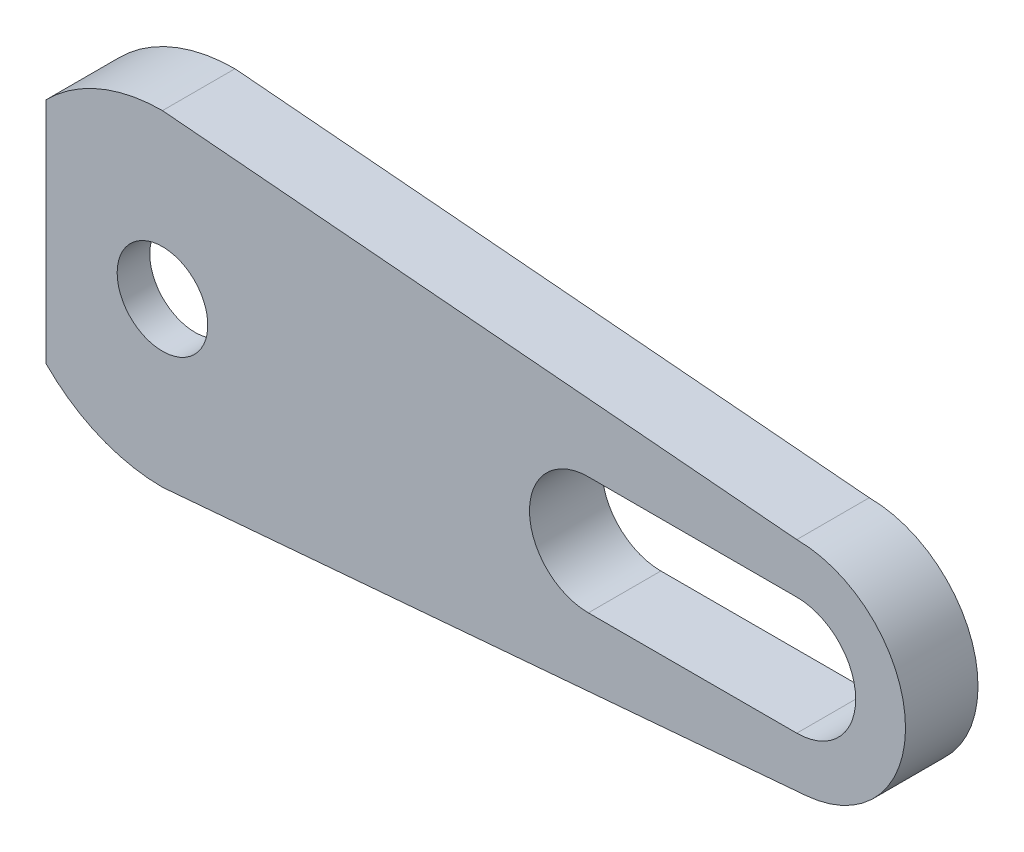
ISO-10303-21;
HEADER;
FILE_DESCRIPTION(('STEP AP214'),'2;1');
FILE_NAME('part.step','',(''),(''),'','','');
FILE_SCHEMA(('AUTOMOTIVE_DESIGN { 1 0 10303 214 1 1 1 1 }'));
ENDSEC;
DATA;
#1=APPLICATION_CONTEXT('core data for automotive mechanical design processes');
#2=APPLICATION_PROTOCOL_DEFINITION('international standard','automotive_design',2000,#1);
#3=PRODUCT_CONTEXT('',#1,'mechanical');
#4=PRODUCT('Part','Part','',(#3));
#5=PRODUCT_RELATED_PRODUCT_CATEGORY('part','',(#4));
#6=PRODUCT_DEFINITION_FORMATION('','',#4);
#7=PRODUCT_DEFINITION_CONTEXT('part definition',#1,'design');
#8=PRODUCT_DEFINITION('design','',#6,#7);
#9=PRODUCT_DEFINITION_SHAPE('','',#8);
#10=(LENGTH_UNIT() NAMED_UNIT(*) SI_UNIT(.MILLI.,.METRE.));
#11=(NAMED_UNIT(*) PLANE_ANGLE_UNIT() SI_UNIT($,.RADIAN.));
#12=(NAMED_UNIT(*) SI_UNIT($,.STERADIAN.) SOLID_ANGLE_UNIT());
#13=UNCERTAINTY_MEASURE_WITH_UNIT(LENGTH_MEASURE(1.E-05),#10,'distance_accuracy_value','');
#14=(GEOMETRIC_REPRESENTATION_CONTEXT(3) GLOBAL_UNCERTAINTY_ASSIGNED_CONTEXT((#13)) GLOBAL_UNIT_ASSIGNED_CONTEXT((#10,
#11,#12)) REPRESENTATION_CONTEXT('',''));
#15=CARTESIAN_POINT('',(0.,0.,0.));
#16=DIRECTION('',(0.,0.,1.));
#17=DIRECTION('',(1.,0.,0.));
#18=AXIS2_PLACEMENT_3D('',#15,#16,#17);
#19=CARTESIAN_POINT('',(0.,0.,4.));
#20=DIRECTION('',(0.,0.,-1.));
#21=DIRECTION('',(-1.,0.,0.));
#22=AXIS2_PLACEMENT_3D('',#19,#20,#21);
#23=PLANE('',#22);
#24=DIRECTION('',(1.,0.,0.));
#25=VECTOR('',#24,1.);
#26=CARTESIAN_POINT('',(23.5,-3.25,4.));
#27=LINE('',#26,#25);
#28=CARTESIAN_POINT('',(23.5,-3.25,4.));
#29=VERTEX_POINT('',#28);
#30=CARTESIAN_POINT('',(35.,-3.25,4.));
#31=VERTEX_POINT('',#30);
#32=EDGE_CURVE('E272',#29,#31,#27,.T.);
#33=ORIENTED_EDGE('',*,*,#32,.F.);
#34=CARTESIAN_POINT('',(23.5,0.,4.));
#35=DIRECTION('',(0.,0.,1.));
#36=DIRECTION('',(1.,0.,0.));
#37=AXIS2_PLACEMENT_3D('',#34,#35,#36);
#38=CIRCLE('',#37,3.25);
#39=CARTESIAN_POINT('',(23.5,3.25,4.));
#40=VERTEX_POINT('',#39);
#41=EDGE_CURVE('E260',#40,#29,#38,.T.);
#42=ORIENTED_EDGE('',*,*,#41,.F.);
#43=DIRECTION('',(-1.,0.,0.));
#44=VECTOR('',#43,1.);
#45=CARTESIAN_POINT('',(23.5,3.25,4.));
#46=LINE('',#45,#44);
#47=CARTESIAN_POINT('',(35.,3.25,4.));
#48=VERTEX_POINT('',#47);
#49=EDGE_CURVE('E256',#48,#40,#46,.T.);
#50=ORIENTED_EDGE('',*,*,#49,.F.);
#51=CARTESIAN_POINT('',(35.,0.,4.));
#52=DIRECTION('',(0.,0.,1.));
#53=DIRECTION('',(-1.,0.,0.));
#54=AXIS2_PLACEMENT_3D('',#51,#52,#53);
#55=CIRCLE('',#54,3.25);
#56=EDGE_CURVE('E270',#31,#48,#55,.T.);
#57=ORIENTED_EDGE('',*,*,#56,.F.);
#58=EDGE_LOOP('',(#33,#42,#50,#57));
#59=FACE_BOUND('',#58,.T.);
#60=DIRECTION('',(0.996398987507184,0.0847883110732758,0.));
#61=VECTOR('',#60,1.);
#62=CARTESIAN_POINT('',(0.,-9.,4.));
#63=LINE('',#62,#61);
#64=CARTESIAN_POINT('',(0.,-9.,4.));
#65=VERTEX_POINT('',#64);
#66=CARTESIAN_POINT('',(35.5087298664397,-5.97839392504311,4.));
#67=VERTEX_POINT('',#66);
#68=EDGE_CURVE('E243',#65,#67,#63,.T.);
#69=ORIENTED_EDGE('',*,*,#68,.T.);
#70=CARTESIAN_POINT('',(35.,0.,4.));
#71=DIRECTION('',(0.,0.,1.));
#72=DIRECTION('',(-1.,0.,0.));
#73=AXIS2_PLACEMENT_3D('',#70,#71,#72);
#74=CIRCLE('',#73,6.);
#75=CARTESIAN_POINT('',(35.,6.,4.));
#76=VERTEX_POINT('',#75);
#77=EDGE_CURVE('E241',#67,#76,#74,.T.);
#78=ORIENTED_EDGE('',*,*,#77,.T.);
#79=DIRECTION('',(-0.996346649041751,0.0854011413464358,0.));
#80=VECTOR('',#79,1.);
#81=CARTESIAN_POINT('',(0.,9.,4.));
#82=LINE('',#81,#80);
#83=CARTESIAN_POINT('',(0.,9.,4.));
#84=VERTEX_POINT('',#83);
#85=EDGE_CURVE('E207',#76,#84,#82,.T.);
#86=ORIENTED_EDGE('',*,*,#85,.T.);
#87=CARTESIAN_POINT('',(0.,0.,4.));
#88=DIRECTION('',(0.,0.,1.));
#89=DIRECTION('',(-1.,0.,0.));
#90=AXIS2_PLACEMENT_3D('',#87,#88,#89);
#91=CIRCLE('',#90,9.);
#92=CARTESIAN_POINT('',(-6.42654307097902,6.30075742723457,4.));
#93=VERTEX_POINT('',#92);
#94=EDGE_CURVE('E211',#84,#93,#91,.T.);
#95=ORIENTED_EDGE('',*,*,#94,.T.);
#96=DIRECTION('',(0.,1.,0.));
#97=VECTOR('',#96,1.);
#98=CARTESIAN_POINT('',(-6.42654307097901,-6.30075742723457,4.));
#99=LINE('',#98,#97);
#100=CARTESIAN_POINT('',(-6.42654307097901,-6.30075742723457,4.));
#101=VERTEX_POINT('',#100);
#102=EDGE_CURVE('E160',#101,#93,#99,.T.);
#103=ORIENTED_EDGE('',*,*,#102,.F.);
#104=CARTESIAN_POINT('',(0.,0.,4.));
#105=DIRECTION('',(0.,0.,1.));
#106=DIRECTION('',(1.,0.,0.));
#107=AXIS2_PLACEMENT_3D('',#104,#105,#106);
#108=CIRCLE('',#107,9.);
#109=EDGE_CURVE('E245',#101,#65,#108,.T.);
#110=ORIENTED_EDGE('',*,*,#109,.T.);
#111=EDGE_LOOP('',(#69,#78,#86,#95,#103,#110));
#112=FACE_BOUND('',#111,.T.);
#113=CARTESIAN_POINT('',(0.,0.,4.));
#114=DIRECTION('',(0.,0.,-1.));
#115=DIRECTION('',(-1.,0.,0.));
#116=AXIS2_PLACEMENT_3D('',#113,#114,#115);
#117=CIRCLE('',#116,2.5);
#118=CARTESIAN_POINT('',(-2.5,0.,4.));
#119=VERTEX_POINT('',#118);
#120=EDGE_CURVE('E291',#119,#119,#117,.T.);
#121=ORIENTED_EDGE('',*,*,#120,.T.);
#122=EDGE_LOOP('',(#121));
#123=FACE_BOUND('',#122,.T.);
#124=ADVANCED_FACE('F35',(#59,#112,#123),#23,.F.);
#125=CARTESIAN_POINT('',(0.,0.,0.));
#126=DIRECTION('',(0.,0.,-1.));
#127=DIRECTION('',(-1.,0.,0.));
#128=AXIS2_PLACEMENT_3D('',#125,#126,#127);
#129=PLANE('',#128);
#130=CARTESIAN_POINT('',(0.,0.,0.));
#131=DIRECTION('',(0.,0.,1.));
#132=DIRECTION('',(-1.,0.,0.));
#133=AXIS2_PLACEMENT_3D('',#130,#131,#132);
#134=CIRCLE('',#133,9.);
#135=CARTESIAN_POINT('',(0.,9.,0.));
#136=VERTEX_POINT('',#135);
#137=CARTESIAN_POINT('',(-6.42654307097901,6.30075742723457,0.));
#138=VERTEX_POINT('',#137);
#139=EDGE_CURVE('E179',#136,#138,#134,.T.);
#140=ORIENTED_EDGE('',*,*,#139,.F.);
#141=DIRECTION('',(-0.996346649041751,0.0854011413464358,0.));
#142=VECTOR('',#141,1.);
#143=CARTESIAN_POINT('',(0.,9.,0.));
#144=LINE('',#143,#142);
#145=CARTESIAN_POINT('',(35.,6.,0.));
#146=VERTEX_POINT('',#145);
#147=EDGE_CURVE('E208',#146,#136,#144,.T.);
#148=ORIENTED_EDGE('',*,*,#147,.F.);
#149=CARTESIAN_POINT('',(35.,0.,0.));
#150=DIRECTION('',(0.,0.,1.));
#151=DIRECTION('',(-1.,0.,0.));
#152=AXIS2_PLACEMENT_3D('',#149,#150,#151);
#153=CIRCLE('',#152,6.);
#154=CARTESIAN_POINT('',(35.5087298664397,-5.97839392504311,0.));
#155=VERTEX_POINT('',#154);
#156=EDGE_CURVE('E212',#155,#146,#153,.T.);
#157=ORIENTED_EDGE('',*,*,#156,.F.);
#158=DIRECTION('',(0.996398987507184,0.0847883110732758,0.));
#159=VECTOR('',#158,1.);
#160=CARTESIAN_POINT('',(0.,-9.,0.));
#161=LINE('',#160,#159);
#162=CARTESIAN_POINT('',(0.,-9.,0.));
#163=VERTEX_POINT('',#162);
#164=EDGE_CURVE('E214',#163,#155,#161,.T.);
#165=ORIENTED_EDGE('',*,*,#164,.F.);
#166=CARTESIAN_POINT('',(0.,0.,0.));
#167=DIRECTION('',(0.,0.,1.));
#168=DIRECTION('',(1.,0.,0.));
#169=AXIS2_PLACEMENT_3D('',#166,#167,#168);
#170=CIRCLE('',#169,9.);
#171=CARTESIAN_POINT('',(-6.42654307097901,-6.30075742723457,0.));
#172=VERTEX_POINT('',#171);
#173=EDGE_CURVE('E216',#172,#163,#170,.T.);
#174=ORIENTED_EDGE('',*,*,#173,.F.);
#175=DIRECTION('',(-0.707106781186548,-0.707106781186548,0.));
#176=VECTOR('',#175,1.);
#177=CARTESIAN_POINT('',(-4.37578564374445,-4.25,0.));
#178=LINE('',#177,#176);
#179=CARTESIAN_POINT('',(-4.37578564374444,-4.25,0.));
#180=VERTEX_POINT('',#179);
#181=EDGE_CURVE('E219',#180,#172,#178,.T.);
#182=ORIENTED_EDGE('',*,*,#181,.F.);
#183=CARTESIAN_POINT('',(0.,0.,0.));
#184=DIRECTION('',(0.,0.,-1.));
#185=DIRECTION('',(-1.,0.,0.));
#186=AXIS2_PLACEMENT_3D('',#183,#184,#185);
#187=CIRCLE('',#186,6.1);
#188=CARTESIAN_POINT('',(4.37578564374445,-4.25,0.));
#189=VERTEX_POINT('',#188);
#190=EDGE_CURVE('E222',#189,#180,#187,.T.);
#191=ORIENTED_EDGE('',*,*,#190,.F.);
#192=DIRECTION('',(-0.993627549913592,-0.112713317991759,0.));
#193=VECTOR('',#192,1.);
#194=CARTESIAN_POINT('',(17.3155972903769,-2.78215713975806,0.));
#195=LINE('',#194,#193);
#196=CARTESIAN_POINT('',(17.3155972903769,-2.78215713975806,0.));
#197=VERTEX_POINT('',#196);
#198=EDGE_CURVE('E225',#197,#189,#195,.T.);
#199=ORIENTED_EDGE('',*,*,#198,.F.);
#200=CARTESIAN_POINT('',(17.,0.,0.));
#201=DIRECTION('',(0.,0.,-1.));
#202=DIRECTION('',(1.,0.,0.));
#203=AXIS2_PLACEMENT_3D('',#200,#201,#202);
#204=CIRCLE('',#203,2.8);
#205=CARTESIAN_POINT('',(17.3155972903769,2.78215713975806,0.));
#206=VERTEX_POINT('',#205);
#207=EDGE_CURVE('E228',#206,#197,#204,.T.);
#208=ORIENTED_EDGE('',*,*,#207,.F.);
#209=DIRECTION('',(0.993627549913592,-0.112713317991759,0.));
#210=VECTOR('',#209,1.);
#211=CARTESIAN_POINT('',(4.37578564374445,4.25,0.));
#212=LINE('',#211,#210);
#213=CARTESIAN_POINT('',(4.37578564374445,4.25,0.));
#214=VERTEX_POINT('',#213);
#215=EDGE_CURVE('E231',#214,#206,#212,.T.);
#216=ORIENTED_EDGE('',*,*,#215,.F.);
#217=CARTESIAN_POINT('',(0.,0.,0.));
#218=DIRECTION('',(0.,0.,-1.));
#219=DIRECTION('',(1.,0.,0.));
#220=AXIS2_PLACEMENT_3D('',#217,#218,#219);
#221=CIRCLE('',#220,6.1);
#222=CARTESIAN_POINT('',(-4.37578564374445,4.25,0.));
#223=VERTEX_POINT('',#222);
#224=EDGE_CURVE('E234',#223,#214,#221,.T.);
#225=ORIENTED_EDGE('',*,*,#224,.F.);
#226=DIRECTION('',(0.707106781186548,-0.707106781186548,0.));
#227=VECTOR('',#226,1.);
#228=CARTESIAN_POINT('',(-4.37578564374445,4.25,0.));
#229=LINE('',#228,#227);
#230=EDGE_CURVE('E236',#138,#223,#229,.T.);
#231=ORIENTED_EDGE('',*,*,#230,.F.);
#232=EDGE_LOOP('',(#140,#148,#157,#165,#174,#182,#191,#199,#208,#216,#225,#231));
#233=FACE_BOUND('',#232,.T.);
#234=DIRECTION('',(-1.,0.,0.));
#235=VECTOR('',#234,1.);
#236=CARTESIAN_POINT('',(23.5,3.25,0.));
#237=LINE('',#236,#235);
#238=CARTESIAN_POINT('',(35.,3.25,0.));
#239=VERTEX_POINT('',#238);
#240=CARTESIAN_POINT('',(23.5,3.25,0.));
#241=VERTEX_POINT('',#240);
#242=EDGE_CURVE('E257',#239,#241,#237,.T.);
#243=ORIENTED_EDGE('',*,*,#242,.T.);
#244=CARTESIAN_POINT('',(23.5,0.,0.));
#245=DIRECTION('',(0.,0.,1.));
#246=DIRECTION('',(1.,0.,0.));
#247=AXIS2_PLACEMENT_3D('',#244,#245,#246);
#248=CIRCLE('',#247,3.25);
#249=CARTESIAN_POINT('',(23.5,-3.25,0.));
#250=VERTEX_POINT('',#249);
#251=EDGE_CURVE('E174',#241,#250,#248,.T.);
#252=ORIENTED_EDGE('',*,*,#251,.T.);
#253=DIRECTION('',(1.,0.,0.));
#254=VECTOR('',#253,1.);
#255=CARTESIAN_POINT('',(23.5,-3.25,0.));
#256=LINE('',#255,#254);
#257=CARTESIAN_POINT('',(35.,-3.25,0.));
#258=VERTEX_POINT('',#257);
#259=EDGE_CURVE('E264',#250,#258,#256,.T.);
#260=ORIENTED_EDGE('',*,*,#259,.T.);
#261=CARTESIAN_POINT('',(35.,0.,0.));
#262=DIRECTION('',(0.,0.,1.));
#263=DIRECTION('',(-1.,0.,0.));
#264=AXIS2_PLACEMENT_3D('',#261,#262,#263);
#265=CIRCLE('',#264,3.25);
#266=EDGE_CURVE('E261',#258,#239,#265,.T.);
#267=ORIENTED_EDGE('',*,*,#266,.T.);
#268=EDGE_LOOP('',(#243,#252,#260,#267));
#269=FACE_BOUND('',#268,.T.);
#270=ADVANCED_FACE('F311',(#233,#269),#129,.T.);
#271=CARTESIAN_POINT('',(0.,0.,4.));
#272=DIRECTION('',(0.,0.,-1.));
#273=DIRECTION('',(-1.,0.,0.));
#274=AXIS2_PLACEMENT_3D('',#271,#272,#273);
#275=CYLINDRICAL_SURFACE('',#274,9.);
#276=DIRECTION('',(0.,0.,-1.));
#277=VECTOR('',#276,1.);
#278=CARTESIAN_POINT('',(-6.42654307097901,6.30075742723457,4.));
#279=LINE('',#278,#277);
#280=CARTESIAN_POINT('',(-6.42654307097902,6.30075742723457,2.2));
#281=VERTEX_POINT('',#280);
#282=EDGE_CURVE('E43',#281,#138,#279,.T.);
#283=ORIENTED_EDGE('',*,*,#282,.F.);
#284=EDGE_CURVE('E11',#93,#281,#279,.T.);
#285=ORIENTED_EDGE('',*,*,#284,.F.);
#286=ORIENTED_EDGE('',*,*,#94,.F.);
#287=DIRECTION('',(0.,0.,-1.));
#288=VECTOR('',#287,1.);
#289=CARTESIAN_POINT('',(0.,9.,4.));
#290=LINE('',#289,#288);
#291=EDGE_CURVE('E205',#84,#136,#290,.T.);
#292=ORIENTED_EDGE('',*,*,#291,.T.);
#293=ORIENTED_EDGE('',*,*,#139,.T.);
#294=EDGE_LOOP('',(#283,#285,#286,#292,#293));
#295=FACE_BOUND('',#294,.T.);
#296=ADVANCED_FACE('F37',(#295),#275,.T.);
#297=CARTESIAN_POINT('',(-4.37578564374445,4.25,4.));
#298=DIRECTION('',(0.707106781186547,0.707106781186547,0.));
#299=DIRECTION('',(-0.707106781186548,0.707106781186548,0.));
#300=AXIS2_PLACEMENT_3D('',#297,#298,#299);
#301=PLANE('',#300);
#302=DIRECTION('',(0.,0.,-1.));
#303=VECTOR('',#302,1.);
#304=CARTESIAN_POINT('',(-4.37578564374445,4.25,4.));
#305=LINE('',#304,#303);
#306=CARTESIAN_POINT('',(-4.37578564374445,4.25,2.2));
#307=VERTEX_POINT('',#306);
#308=EDGE_CURVE('E173',#307,#223,#305,.T.);
#309=ORIENTED_EDGE('',*,*,#308,.F.);
#310=DIRECTION('',(-0.707106781186548,0.707106781186548,0.));
#311=VECTOR('',#310,1.);
#312=CARTESIAN_POINT('',(-4.37578564374445,4.25,2.2));
#313=LINE('',#312,#311);
#314=EDGE_CURVE('E155',#307,#281,#313,.T.);
#315=ORIENTED_EDGE('',*,*,#314,.T.);
#316=ORIENTED_EDGE('',*,*,#282,.T.);
#317=ORIENTED_EDGE('',*,*,#230,.T.);
#318=EDGE_LOOP('',(#309,#315,#316,#317));
#319=FACE_BOUND('',#318,.T.);
#320=ADVANCED_FACE('F170',(#319),#301,.F.);
#321=CARTESIAN_POINT('',(0.,0.,4.));
#322=DIRECTION('',(0.,0.,-1.));
#323=DIRECTION('',(-1.,0.,0.));
#324=AXIS2_PLACEMENT_3D('',#321,#322,#323);
#325=CYLINDRICAL_SURFACE('',#324,6.1);
#326=DIRECTION('',(0.,0.,-1.));
#327=VECTOR('',#326,1.);
#328=CARTESIAN_POINT('',(4.37578564374445,4.25,4.));
#329=LINE('',#328,#327);
#330=CARTESIAN_POINT('',(4.37578564374445,4.25,2.2));
#331=VERTEX_POINT('',#330);
#332=EDGE_CURVE('E180',#331,#214,#329,.T.);
#333=ORIENTED_EDGE('',*,*,#332,.F.);
#334=CARTESIAN_POINT('',(0.,0.,2.2));
#335=DIRECTION('',(0.,0.,-1.));
#336=DIRECTION('',(-1.,0.,0.));
#337=AXIS2_PLACEMENT_3D('',#334,#335,#336);
#338=CIRCLE('',#337,6.1);
#339=EDGE_CURVE('E175',#331,#307,#338,.F.);
#340=ORIENTED_EDGE('',*,*,#339,.T.);
#341=ORIENTED_EDGE('',*,*,#308,.T.);
#342=ORIENTED_EDGE('',*,*,#224,.T.);
#343=EDGE_LOOP('',(#333,#340,#341,#342));
#344=FACE_BOUND('',#343,.T.);
#345=ADVANCED_FACE('F360',(#344),#325,.F.);
#346=CARTESIAN_POINT('',(4.37578564374445,4.25,4.));
#347=DIRECTION('',(0.112713317991759,0.993627549913592,0.));
#348=DIRECTION('',(-0.993627549913592,0.112713317991759,0.));
#349=AXIS2_PLACEMENT_3D('',#346,#347,#348);
#350=PLANE('',#349);
#351=DIRECTION('',(0.,0.,-1.));
#352=VECTOR('',#351,1.);
#353=CARTESIAN_POINT('',(17.3155972903769,2.78215713975806,4.));
#354=LINE('',#353,#352);
#355=CARTESIAN_POINT('',(17.3155972903769,2.78215713975806,2.2));
#356=VERTEX_POINT('',#355);
#357=EDGE_CURVE('E183',#356,#206,#354,.T.);
#358=ORIENTED_EDGE('',*,*,#357,.F.);
#359=DIRECTION('',(-0.993627549913592,0.112713317991759,0.));
#360=VECTOR('',#359,1.);
#361=CARTESIAN_POINT('',(4.37578564374445,4.25,2.2));
#362=LINE('',#361,#360);
#363=EDGE_CURVE('E276',#356,#331,#362,.T.);
#364=ORIENTED_EDGE('',*,*,#363,.T.);
#365=ORIENTED_EDGE('',*,*,#332,.T.);
#366=ORIENTED_EDGE('',*,*,#215,.T.);
#367=EDGE_LOOP('',(#358,#364,#365,#366));
#368=FACE_BOUND('',#367,.T.);
#369=ADVANCED_FACE('F356',(#368),#350,.F.);
#370=CARTESIAN_POINT('',(17.,0.,4.));
#371=DIRECTION('',(0.,0.,-1.));
#372=DIRECTION('',(-1.,0.,0.));
#373=AXIS2_PLACEMENT_3D('',#370,#371,#372);
#374=CYLINDRICAL_SURFACE('',#373,2.8);
#375=DIRECTION('',(0.,0.,-1.));
#376=VECTOR('',#375,1.);
#377=CARTESIAN_POINT('',(17.3155972903769,-2.78215713975806,4.));
#378=LINE('',#377,#376);
#379=CARTESIAN_POINT('',(17.3155972903769,-2.78215713975806,2.2));
#380=VERTEX_POINT('',#379);
#381=EDGE_CURVE('E187',#380,#197,#378,.T.);
#382=ORIENTED_EDGE('',*,*,#381,.F.);
#383=CARTESIAN_POINT('',(17.,0.,2.2));
#384=DIRECTION('',(0.,0.,-1.));
#385=DIRECTION('',(-1.,0.,0.));
#386=AXIS2_PLACEMENT_3D('',#383,#384,#385);
#387=CIRCLE('',#386,2.8);
#388=EDGE_CURVE('E279',#380,#356,#387,.F.);
#389=ORIENTED_EDGE('',*,*,#388,.T.);
#390=ORIENTED_EDGE('',*,*,#357,.T.);
#391=ORIENTED_EDGE('',*,*,#207,.T.);
#392=EDGE_LOOP('',(#382,#389,#390,#391));
#393=FACE_BOUND('',#392,.T.);
#394=ADVANCED_FACE('F352',(#393),#374,.F.);
#395=CARTESIAN_POINT('',(17.3155972903769,-2.78215713975806,4.));
#396=DIRECTION('',(0.112713317991759,-0.993627549913592,0.));
#397=DIRECTION('',(0.993627549913592,0.112713317991759,0.));
#398=AXIS2_PLACEMENT_3D('',#395,#396,#397);
#399=PLANE('',#398);
#400=DIRECTION('',(0.,0.,-1.));
#401=VECTOR('',#400,1.);
#402=CARTESIAN_POINT('',(4.37578564374445,-4.25,4.));
#403=LINE('',#402,#401);
#404=CARTESIAN_POINT('',(4.37578564374445,-4.25,2.2));
#405=VERTEX_POINT('',#404);
#406=EDGE_CURVE('E189',#405,#189,#403,.T.);
#407=ORIENTED_EDGE('',*,*,#406,.F.);
#408=DIRECTION('',(0.993627549913592,0.112713317991759,0.));
#409=VECTOR('',#408,1.);
#410=CARTESIAN_POINT('',(17.3155972903769,-2.78215713975806,2.2));
#411=LINE('',#410,#409);
#412=EDGE_CURVE('E282',#405,#380,#411,.T.);
#413=ORIENTED_EDGE('',*,*,#412,.T.);
#414=ORIENTED_EDGE('',*,*,#381,.T.);
#415=ORIENTED_EDGE('',*,*,#198,.T.);
#416=EDGE_LOOP('',(#407,#413,#414,#415));
#417=FACE_BOUND('',#416,.T.);
#418=ADVANCED_FACE('F348',(#417),#399,.F.);
#419=CARTESIAN_POINT('',(0.,0.,4.));
#420=DIRECTION('',(0.,0.,-1.));
#421=DIRECTION('',(-1.,0.,0.));
#422=AXIS2_PLACEMENT_3D('',#419,#420,#421);
#423=CYLINDRICAL_SURFACE('',#422,6.1);
#424=DIRECTION('',(0.,0.,-1.));
#425=VECTOR('',#424,1.);
#426=CARTESIAN_POINT('',(-4.37578564374444,-4.25,4.));
#427=LINE('',#426,#425);
#428=CARTESIAN_POINT('',(-4.37578564374445,-4.25,2.2));
#429=VERTEX_POINT('',#428);
#430=EDGE_CURVE('E191',#429,#180,#427,.T.);
#431=ORIENTED_EDGE('',*,*,#430,.F.);
#432=CARTESIAN_POINT('',(0.,0.,2.2));
#433=DIRECTION('',(0.,0.,-1.));
#434=DIRECTION('',(-1.,0.,0.));
#435=AXIS2_PLACEMENT_3D('',#432,#433,#434);
#436=CIRCLE('',#435,6.1);
#437=EDGE_CURVE('E285',#429,#405,#436,.F.);
#438=ORIENTED_EDGE('',*,*,#437,.T.);
#439=ORIENTED_EDGE('',*,*,#406,.T.);
#440=ORIENTED_EDGE('',*,*,#190,.T.);
#441=EDGE_LOOP('',(#431,#438,#439,#440));
#442=FACE_BOUND('',#441,.T.);
#443=ADVANCED_FACE('F344',(#442),#423,.F.);
#444=CARTESIAN_POINT('',(-4.37578564374445,-4.25,4.));
#445=DIRECTION('',(0.707106781186547,-0.707106781186547,0.));
#446=DIRECTION('',(0.707106781186548,0.707106781186548,0.));
#447=AXIS2_PLACEMENT_3D('',#444,#445,#446);
#448=PLANE('',#447);
#449=DIRECTION('',(0.,0.,-1.));
#450=VECTOR('',#449,1.);
#451=CARTESIAN_POINT('',(-6.42654307097901,-6.30075742723457,4.));
#452=LINE('',#451,#450);
#453=CARTESIAN_POINT('',(-6.42654307097901,-6.30075742723457,2.2));
#454=VERTEX_POINT('',#453);
#455=EDGE_CURVE('E196',#454,#172,#452,.T.);
#456=ORIENTED_EDGE('',*,*,#455,.F.);
#457=DIRECTION('',(0.707106781186548,0.707106781186548,0.));
#458=VECTOR('',#457,1.);
#459=CARTESIAN_POINT('',(-4.37578564374445,-4.25,2.2));
#460=LINE('',#459,#458);
#461=EDGE_CURVE('E158',#454,#429,#460,.T.);
#462=ORIENTED_EDGE('',*,*,#461,.T.);
#463=ORIENTED_EDGE('',*,*,#430,.T.);
#464=ORIENTED_EDGE('',*,*,#181,.T.);
#465=EDGE_LOOP('',(#456,#462,#463,#464));
#466=FACE_BOUND('',#465,.T.);
#467=ADVANCED_FACE('F340',(#466),#448,.F.);
#468=CARTESIAN_POINT('',(0.,0.,4.));
#469=DIRECTION('',(0.,0.,-1.));
#470=DIRECTION('',(-1.,0.,0.));
#471=AXIS2_PLACEMENT_3D('',#468,#469,#470);
#472=CYLINDRICAL_SURFACE('',#471,9.);
#473=ORIENTED_EDGE('',*,*,#173,.T.);
#474=DIRECTION('',(0.,0.,-1.));
#475=VECTOR('',#474,1.);
#476=CARTESIAN_POINT('',(0.,-9.,4.));
#477=LINE('',#476,#475);
#478=EDGE_CURVE('E197',#65,#163,#477,.T.);
#479=ORIENTED_EDGE('',*,*,#478,.F.);
#480=ORIENTED_EDGE('',*,*,#109,.F.);
#481=EDGE_CURVE('E193',#101,#454,#452,.T.);
#482=ORIENTED_EDGE('',*,*,#481,.T.);
#483=ORIENTED_EDGE('',*,*,#455,.T.);
#484=EDGE_LOOP('',(#473,#479,#480,#482,#483));
#485=FACE_BOUND('',#484,.T.);
#486=ADVANCED_FACE('F336',(#485),#472,.T.);
#487=CARTESIAN_POINT('',(0.,-9.,4.));
#488=DIRECTION('',(-0.0847883110732758,0.996398987507184,0.));
#489=DIRECTION('',(-0.996398987507184,-0.0847883110732758,0.));
#490=AXIS2_PLACEMENT_3D('',#487,#488,#489);
#491=PLANE('',#490);
#492=ORIENTED_EDGE('',*,*,#478,.T.);
#493=ORIENTED_EDGE('',*,*,#164,.T.);
#494=DIRECTION('',(0.,0.,-1.));
#495=VECTOR('',#494,1.);
#496=CARTESIAN_POINT('',(35.5087298664397,-5.97839392504311,4.));
#497=LINE('',#496,#495);
#498=EDGE_CURVE('E199',#67,#155,#497,.T.);
#499=ORIENTED_EDGE('',*,*,#498,.F.);
#500=ORIENTED_EDGE('',*,*,#68,.F.);
#501=EDGE_LOOP('',(#492,#493,#499,#500));
#502=FACE_BOUND('',#501,.T.);
#503=ADVANCED_FACE('F332',(#502),#491,.F.);
#504=CARTESIAN_POINT('',(35.,0.,4.));
#505=DIRECTION('',(0.,0.,-1.));
#506=DIRECTION('',(-1.,0.,0.));
#507=AXIS2_PLACEMENT_3D('',#504,#505,#506);
#508=CYLINDRICAL_SURFACE('',#507,6.);
#509=ORIENTED_EDGE('',*,*,#156,.T.);
#510=DIRECTION('',(0.,0.,-1.));
#511=VECTOR('',#510,1.);
#512=CARTESIAN_POINT('',(35.,6.,4.));
#513=LINE('',#512,#511);
#514=EDGE_CURVE('E202',#76,#146,#513,.T.);
#515=ORIENTED_EDGE('',*,*,#514,.F.);
#516=ORIENTED_EDGE('',*,*,#77,.F.);
#517=ORIENTED_EDGE('',*,*,#498,.T.);
#518=EDGE_LOOP('',(#509,#515,#516,#517));
#519=FACE_BOUND('',#518,.T.);
#520=ADVANCED_FACE('F328',(#519),#508,.T.);
#521=CARTESIAN_POINT('',(0.,9.,4.));
#522=DIRECTION('',(-0.0854011413464358,-0.996346649041751,0.));
#523=DIRECTION('',(0.996346649041751,-0.0854011413464358,0.));
#524=AXIS2_PLACEMENT_3D('',#521,#522,#523);
#525=PLANE('',#524);
#526=ORIENTED_EDGE('',*,*,#147,.T.);
#527=ORIENTED_EDGE('',*,*,#291,.F.);
#528=ORIENTED_EDGE('',*,*,#85,.F.);
#529=ORIENTED_EDGE('',*,*,#514,.T.);
#530=EDGE_LOOP('',(#526,#527,#528,#529));
#531=FACE_BOUND('',#530,.T.);
#532=ADVANCED_FACE('F325',(#531),#525,.F.);
#533=CARTESIAN_POINT('',(23.5,0.,4.));
#534=DIRECTION('',(0.,0.,-1.));
#535=DIRECTION('',(-1.,0.,0.));
#536=AXIS2_PLACEMENT_3D('',#533,#534,#535);
#537=CYLINDRICAL_SURFACE('',#536,3.25);
#538=ORIENTED_EDGE('',*,*,#41,.T.);
#539=DIRECTION('',(0.,0.,-1.));
#540=VECTOR('',#539,1.);
#541=CARTESIAN_POINT('',(23.5,-3.25,4.));
#542=LINE('',#541,#540);
#543=EDGE_CURVE('E239',#29,#250,#542,.T.);
#544=ORIENTED_EDGE('',*,*,#543,.T.);
#545=ORIENTED_EDGE('',*,*,#251,.F.);
#546=DIRECTION('',(0.,0.,-1.));
#547=VECTOR('',#546,1.);
#548=CARTESIAN_POINT('',(23.5,3.25,4.));
#549=LINE('',#548,#547);
#550=EDGE_CURVE('E253',#40,#241,#549,.T.);
#551=ORIENTED_EDGE('',*,*,#550,.F.);
#552=EDGE_LOOP('',(#538,#544,#545,#551));
#553=FACE_BOUND('',#552,.T.);
#554=ADVANCED_FACE('F322',(#553),#537,.F.);
#555=CARTESIAN_POINT('',(23.5,-3.25,4.));
#556=DIRECTION('',(0.,1.,0.));
#557=DIRECTION('',(-1.,0.,0.));
#558=AXIS2_PLACEMENT_3D('',#555,#556,#557);
#559=PLANE('',#558);
#560=ORIENTED_EDGE('',*,*,#259,.F.);
#561=ORIENTED_EDGE('',*,*,#543,.F.);
#562=ORIENTED_EDGE('',*,*,#32,.T.);
#563=DIRECTION('',(0.,0.,-1.));
#564=VECTOR('',#563,1.);
#565=CARTESIAN_POINT('',(35.,-3.25,4.));
#566=LINE('',#565,#564);
#567=EDGE_CURVE('E250',#31,#258,#566,.T.);
#568=ORIENTED_EDGE('',*,*,#567,.T.);
#569=EDGE_LOOP('',(#560,#561,#562,#568));
#570=FACE_BOUND('',#569,.T.);
#571=ADVANCED_FACE('F387',(#570),#559,.T.);
#572=CARTESIAN_POINT('',(35.,0.,4.));
#573=DIRECTION('',(0.,0.,-1.));
#574=DIRECTION('',(-1.,0.,0.));
#575=AXIS2_PLACEMENT_3D('',#572,#573,#574);
#576=CYLINDRICAL_SURFACE('',#575,3.25);
#577=ORIENTED_EDGE('',*,*,#266,.F.);
#578=ORIENTED_EDGE('',*,*,#567,.F.);
#579=ORIENTED_EDGE('',*,*,#56,.T.);
#580=DIRECTION('',(0.,0.,-1.));
#581=VECTOR('',#580,1.);
#582=CARTESIAN_POINT('',(35.,3.25,4.));
#583=LINE('',#582,#581);
#584=EDGE_CURVE('E57',#48,#239,#583,.T.);
#585=ORIENTED_EDGE('',*,*,#584,.T.);
#586=EDGE_LOOP('',(#577,#578,#579,#585));
#587=FACE_BOUND('',#586,.T.);
#588=ADVANCED_FACE('F307',(#587),#576,.F.);
#589=CARTESIAN_POINT('',(23.5,3.25,4.));
#590=DIRECTION('',(0.,-1.,0.));
#591=DIRECTION('',(1.,0.,0.));
#592=AXIS2_PLACEMENT_3D('',#589,#590,#591);
#593=PLANE('',#592);
#594=ORIENTED_EDGE('',*,*,#242,.F.);
#595=ORIENTED_EDGE('',*,*,#584,.F.);
#596=ORIENTED_EDGE('',*,*,#49,.T.);
#597=ORIENTED_EDGE('',*,*,#550,.T.);
#598=EDGE_LOOP('',(#594,#595,#596,#597));
#599=FACE_BOUND('',#598,.T.);
#600=ADVANCED_FACE('F300',(#599),#593,.T.);
#601=CARTESIAN_POINT('',(0.,0.,2.2));
#602=DIRECTION('',(0.,0.,-1.));
#603=DIRECTION('',(-1.,0.,0.));
#604=AXIS2_PLACEMENT_3D('',#601,#602,#603);
#605=PLANE('',#604);
#606=ORIENTED_EDGE('',*,*,#314,.F.);
#607=ORIENTED_EDGE('',*,*,#339,.F.);
#608=ORIENTED_EDGE('',*,*,#363,.F.);
#609=ORIENTED_EDGE('',*,*,#388,.F.);
#610=ORIENTED_EDGE('',*,*,#412,.F.);
#611=ORIENTED_EDGE('',*,*,#437,.F.);
#612=ORIENTED_EDGE('',*,*,#461,.F.);
#613=DIRECTION('',(0.,1.,0.));
#614=VECTOR('',#613,1.);
#615=CARTESIAN_POINT('',(-6.42654307097901,-6.30075742723457,2.2));
#616=LINE('',#615,#614);
#617=EDGE_CURVE('E49',#454,#281,#616,.T.);
#618=ORIENTED_EDGE('',*,*,#617,.T.);
#619=EDGE_LOOP('',(#606,#607,#608,#609,#610,#611,#612,#618));
#620=FACE_BOUND('',#619,.T.);
#621=CARTESIAN_POINT('',(0.,0.,2.2));
#622=DIRECTION('',(0.,0.,-1.));
#623=DIRECTION('',(-1.,0.,0.));
#624=AXIS2_PLACEMENT_3D('',#621,#622,#623);
#625=CIRCLE('',#624,2.5);
#626=CARTESIAN_POINT('',(-2.5,0.,2.2));
#627=VERTEX_POINT('',#626);
#628=EDGE_CURVE('E289',#627,#627,#625,.T.);
#629=ORIENTED_EDGE('',*,*,#628,.F.);
#630=EDGE_LOOP('',(#629));
#631=FACE_BOUND('',#630,.T.);
#632=ADVANCED_FACE('F152',(#620,#631),#605,.T.);
#633=CARTESIAN_POINT('',(-6.42654307097901,-6.30075742723457,2.2));
#634=DIRECTION('',(1.,0.,0.));
#635=DIRECTION('',(0.,0.,-1.));
#636=AXIS2_PLACEMENT_3D('',#633,#634,#635);
#637=PLANE('',#636);
#638=ORIENTED_EDGE('',*,*,#102,.T.);
#639=ORIENTED_EDGE('',*,*,#284,.T.);
#640=ORIENTED_EDGE('',*,*,#617,.F.);
#641=ORIENTED_EDGE('',*,*,#481,.F.);
#642=EDGE_LOOP('',(#638,#639,#640,#641));
#643=FACE_BOUND('',#642,.T.);
#644=ADVANCED_FACE('F163',(#643),#637,.F.);
#645=CARTESIAN_POINT('',(0.,0.,2.2));
#646=DIRECTION('',(0.,0.,1.));
#647=DIRECTION('',(1.,0.,0.));
#648=AXIS2_PLACEMENT_3D('',#645,#646,#647);
#649=CYLINDRICAL_SURFACE('',#648,2.5);
#650=ORIENTED_EDGE('',*,*,#628,.T.);
#651=EDGE_LOOP('',(#650));
#652=FACE_BOUND('',#651,.T.);
#653=ORIENTED_EDGE('',*,*,#120,.F.);
#654=EDGE_LOOP('',(#653));
#655=FACE_BOUND('',#654,.T.);
#656=ADVANCED_FACE('F297',(#652,#655),#649,.F.);
#657=CLOSED_SHELL('',(#124,#270,#296,#320,#345,#369,#394,#418,#443,#467,#486,#503,#520,#532,
#554,#571,#588,#600,#632,#644,#656));
#658=MANIFOLD_SOLID_BREP('B2',#657);
#659=ADVANCED_BREP_SHAPE_REPRESENTATION('',(#18,#658),#14);
#660=SHAPE_DEFINITION_REPRESENTATION(#9,#659);
ENDSEC;
END-ISO-10303-21;
